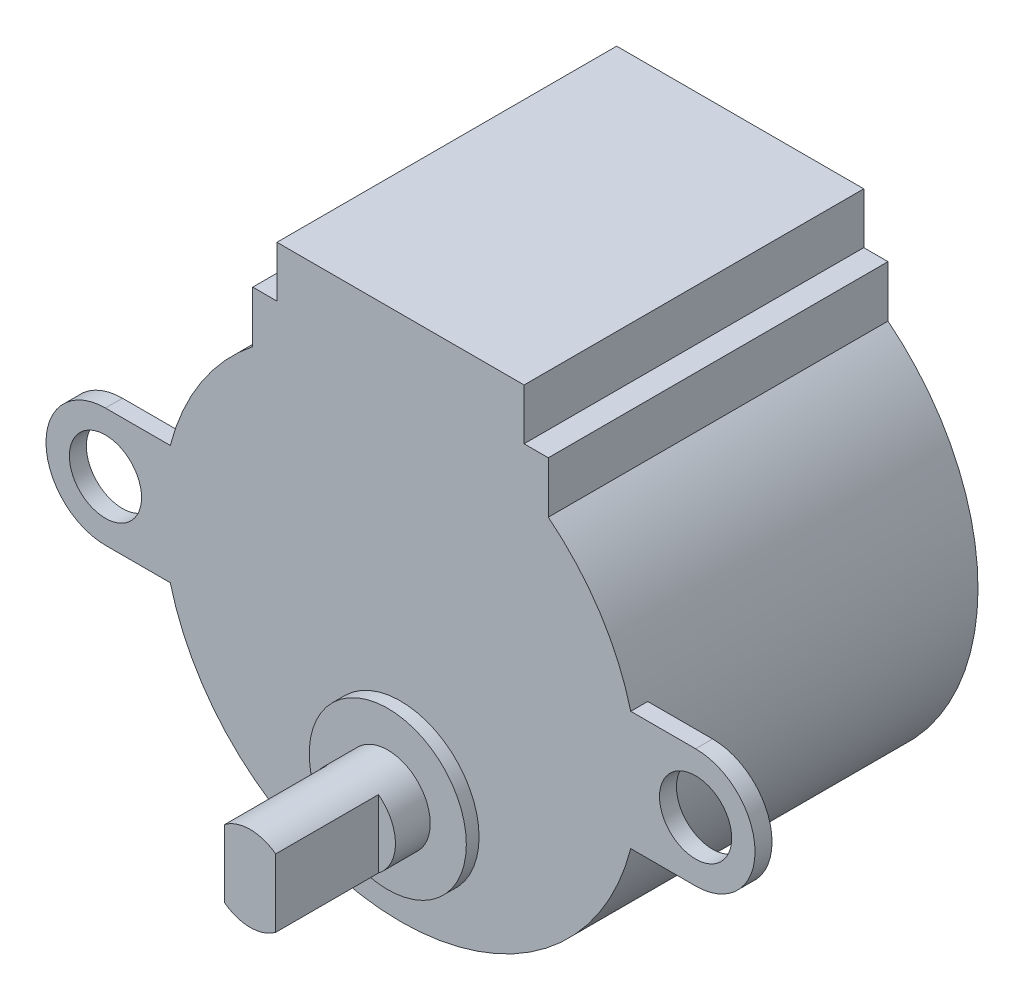
ISO-10303-21;
HEADER;
FILE_DESCRIPTION(('STEP AP214'),'2;1');
FILE_NAME('part.step','',(''),(''),'','','');
FILE_SCHEMA(('AUTOMOTIVE_DESIGN { 1 0 10303 214 1 1 1 1 }'));
ENDSEC;
DATA;
#1=APPLICATION_CONTEXT('core data for automotive mechanical design processes');
#2=APPLICATION_PROTOCOL_DEFINITION('international standard','automotive_design',2000,#1);
#3=PRODUCT_CONTEXT('',#1,'mechanical');
#4=PRODUCT('Part','Part','',(#3));
#5=PRODUCT_RELATED_PRODUCT_CATEGORY('part','',(#4));
#6=PRODUCT_DEFINITION_FORMATION('','',#4);
#7=PRODUCT_DEFINITION_CONTEXT('part definition',#1,'design');
#8=PRODUCT_DEFINITION('design','',#6,#7);
#9=PRODUCT_DEFINITION_SHAPE('','',#8);
#10=(LENGTH_UNIT() NAMED_UNIT(*) SI_UNIT(.MILLI.,.METRE.));
#11=(NAMED_UNIT(*) PLANE_ANGLE_UNIT() SI_UNIT($,.RADIAN.));
#12=(NAMED_UNIT(*) SI_UNIT($,.STERADIAN.) SOLID_ANGLE_UNIT());
#13=UNCERTAINTY_MEASURE_WITH_UNIT(LENGTH_MEASURE(1.E-05),#10,'distance_accuracy_value','');
#14=(GEOMETRIC_REPRESENTATION_CONTEXT(3) GLOBAL_UNCERTAINTY_ASSIGNED_CONTEXT((#13)) GLOBAL_UNIT_ASSIGNED_CONTEXT((#10,
#11,#12)) REPRESENTATION_CONTEXT('',''));
#15=CARTESIAN_POINT('',(0.,0.,0.));
#16=DIRECTION('',(0.,0.,1.));
#17=DIRECTION('',(1.,0.,0.));
#18=AXIS2_PLACEMENT_3D('',#15,#16,#17);
#19=CARTESIAN_POINT('',(0.,0.,22.8));
#20=DIRECTION('',(0.,0.,1.));
#21=DIRECTION('',(1.,0.,0.));
#22=AXIS2_PLACEMENT_3D('',#19,#20,#21);
#23=PLANE('',#22);
#24=DIRECTION('',(0.,-1.,0.));
#25=VECTOR('',#24,1.);
#26=CARTESIAN_POINT('',(-1.5,-9.375,22.8));
#27=LINE('',#26,#25);
#28=CARTESIAN_POINT('',(-1.5,-5.375,22.8));
#29=VERTEX_POINT('',#28);
#30=CARTESIAN_POINT('',(-1.5,-9.375,22.8));
#31=VERTEX_POINT('',#30);
#32=EDGE_CURVE('E196',#29,#31,#27,.T.);
#33=ORIENTED_EDGE('',*,*,#32,.F.);
#34=CARTESIAN_POINT('',(0.,-7.375,22.8));
#35=DIRECTION('',(0.,0.,1.));
#36=DIRECTION('',(1.,0.,0.));
#37=AXIS2_PLACEMENT_3D('',#34,#35,#36);
#38=CIRCLE('',#37,2.5);
#39=EDGE_CURVE('E71',#29,#31,#38,.T.);
#40=ORIENTED_EDGE('',*,*,#39,.T.);
#41=EDGE_LOOP('',(#33,#40));
#42=FACE_BOUND('',#41,.T.);
#43=ADVANCED_FACE('F47',(#42),#23,.T.);
#44=CARTESIAN_POINT('',(-8.7,14.,20.));
#45=DIRECTION('',(0.,-1.,0.));
#46=DIRECTION('',(0.,0.,-1.));
#47=AXIS2_PLACEMENT_3D('',#44,#45,#46);
#48=PLANE('',#47);
#49=DIRECTION('',(-1.,0.,0.));
#50=VECTOR('',#49,1.);
#51=CARTESIAN_POINT('',(-8.7,14.,0.));
#52=LINE('',#51,#50);
#53=CARTESIAN_POINT('',(-7.275,14.,0.));
#54=VERTEX_POINT('',#53);
#55=CARTESIAN_POINT('',(-8.7,14.,0.));
#56=VERTEX_POINT('',#55);
#57=EDGE_CURVE('E320',#54,#56,#52,.T.);
#58=ORIENTED_EDGE('',*,*,#57,.T.);
#59=DIRECTION('',(0.,0.,-1.));
#60=VECTOR('',#59,1.);
#61=CARTESIAN_POINT('',(-8.7,14.,20.));
#62=LINE('',#61,#60);
#63=CARTESIAN_POINT('',(-8.7,14.,20.));
#64=VERTEX_POINT('',#63);
#65=EDGE_CURVE('E400',#64,#56,#62,.T.);
#66=ORIENTED_EDGE('',*,*,#65,.F.);
#67=DIRECTION('',(-1.,0.,0.));
#68=VECTOR('',#67,1.);
#69=CARTESIAN_POINT('',(-8.7,14.,20.));
#70=LINE('',#69,#68);
#71=CARTESIAN_POINT('',(-7.275,14.,20.));
#72=VERTEX_POINT('',#71);
#73=EDGE_CURVE('E321',#72,#64,#70,.T.);
#74=ORIENTED_EDGE('',*,*,#73,.F.);
#75=DIRECTION('',(0.,0.,-1.));
#76=VECTOR('',#75,1.);
#77=CARTESIAN_POINT('',(-7.275,14.,20.));
#78=LINE('',#77,#76);
#79=EDGE_CURVE('E350',#72,#54,#78,.T.);
#80=ORIENTED_EDGE('',*,*,#79,.T.);
#81=EDGE_LOOP('',(#58,#66,#74,#80));
#82=FACE_BOUND('',#81,.T.);
#83=ADVANCED_FACE('F49',(#82),#48,.F.);
#84=CARTESIAN_POINT('',(-8.7,14.,20.));
#85=DIRECTION('',(1.,0.,0.));
#86=DIRECTION('',(0.,0.,-1.));
#87=AXIS2_PLACEMENT_3D('',#84,#85,#86);
#88=PLANE('',#87);
#89=DIRECTION('',(0.,-1.,0.));
#90=VECTOR('',#89,1.);
#91=CARTESIAN_POINT('',(-8.7,14.,0.));
#92=LINE('',#91,#90);
#93=CARTESIAN_POINT('',(-8.7,10.9685915230717,0.));
#94=VERTEX_POINT('',#93);
#95=EDGE_CURVE('E354',#56,#94,#92,.T.);
#96=ORIENTED_EDGE('',*,*,#95,.T.);
#97=DIRECTION('',(0.,0.,-1.));
#98=VECTOR('',#97,1.);
#99=CARTESIAN_POINT('',(-8.7,10.9685915230717,20.));
#100=LINE('',#99,#98);
#101=CARTESIAN_POINT('',(-8.7,10.9685915230717,20.));
#102=VERTEX_POINT('',#101);
#103=EDGE_CURVE('E397',#102,#94,#100,.T.);
#104=ORIENTED_EDGE('',*,*,#103,.F.);
#105=DIRECTION('',(0.,-1.,0.));
#106=VECTOR('',#105,1.);
#107=CARTESIAN_POINT('',(-8.7,14.,20.));
#108=LINE('',#107,#106);
#109=EDGE_CURVE('E325',#64,#102,#108,.T.);
#110=ORIENTED_EDGE('',*,*,#109,.F.);
#111=ORIENTED_EDGE('',*,*,#65,.T.);
#112=EDGE_LOOP('',(#96,#104,#110,#111));
#113=FACE_BOUND('',#112,.T.);
#114=ADVANCED_FACE('F466',(#113),#88,.F.);
#115=CARTESIAN_POINT('',(0.,0.,20.));
#116=DIRECTION('',(0.,0.,-1.));
#117=DIRECTION('',(-1.,0.,0.));
#118=AXIS2_PLACEMENT_3D('',#115,#116,#117);
#119=CYLINDRICAL_SURFACE('',#118,14.);
#120=CARTESIAN_POINT('',(0.,0.,19.));
#121=DIRECTION('',(0.,0.,1.));
#122=DIRECTION('',(1.,0.,0.));
#123=AXIS2_PLACEMENT_3D('',#120,#121,#122);
#124=CIRCLE('',#123,14.);
#125=CARTESIAN_POINT('',(-13.555441711726,3.5,19.));
#126=VERTEX_POINT('',#125);
#127=CARTESIAN_POINT('',(-13.555441711726,-3.5,19.));
#128=VERTEX_POINT('',#127);
#129=EDGE_CURVE('E57',#126,#128,#124,.T.);
#130=ORIENTED_EDGE('',*,*,#129,.F.);
#131=DIRECTION('',(0.,0.,-1.));
#132=VECTOR('',#131,1.);
#133=CARTESIAN_POINT('',(-13.555441711726,3.5,20.));
#134=LINE('',#133,#132);
#135=CARTESIAN_POINT('',(-13.555441711726,3.5,20.));
#136=VERTEX_POINT('',#135);
#137=EDGE_CURVE('E312',#126,#136,#134,.F.);
#138=ORIENTED_EDGE('',*,*,#137,.T.);
#139=CARTESIAN_POINT('',(0.,0.,20.));
#140=DIRECTION('',(0.,0.,1.));
#141=DIRECTION('',(1.,0.,0.));
#142=AXIS2_PLACEMENT_3D('',#139,#140,#141);
#143=CIRCLE('',#142,14.);
#144=EDGE_CURVE('E330',#102,#136,#143,.T.);
#145=ORIENTED_EDGE('',*,*,#144,.F.);
#146=ORIENTED_EDGE('',*,*,#103,.T.);
#147=CARTESIAN_POINT('',(0.,0.,0.));
#148=DIRECTION('',(0.,0.,1.));
#149=DIRECTION('',(1.,0.,0.));
#150=AXIS2_PLACEMENT_3D('',#147,#148,#149);
#151=CIRCLE('',#150,14.);
#152=CARTESIAN_POINT('',(8.7,10.9685915230717,0.));
#153=VERTEX_POINT('',#152);
#154=EDGE_CURVE('E357',#94,#153,#151,.T.);
#155=ORIENTED_EDGE('',*,*,#154,.T.);
#156=DIRECTION('',(0.,0.,-1.));
#157=VECTOR('',#156,1.);
#158=CARTESIAN_POINT('',(8.7,10.9685915230717,20.));
#159=LINE('',#158,#157);
#160=CARTESIAN_POINT('',(8.7,10.9685915230717,20.));
#161=VERTEX_POINT('',#160);
#162=EDGE_CURVE('E393',#161,#153,#159,.T.);
#163=ORIENTED_EDGE('',*,*,#162,.F.);
#164=CARTESIAN_POINT('',(13.555441711726,3.5,20.));
#165=VERTEX_POINT('',#164);
#166=EDGE_CURVE('E329',#165,#161,#143,.T.);
#167=ORIENTED_EDGE('',*,*,#166,.F.);
#168=DIRECTION('',(0.,0.,-1.));
#169=VECTOR('',#168,1.);
#170=CARTESIAN_POINT('',(13.555441711726,3.5,20.));
#171=LINE('',#170,#169);
#172=CARTESIAN_POINT('',(13.555441711726,3.5,19.));
#173=VERTEX_POINT('',#172);
#174=EDGE_CURVE('E316',#165,#173,#171,.T.);
#175=ORIENTED_EDGE('',*,*,#174,.T.);
#176=CARTESIAN_POINT('',(13.555441711726,-3.5,19.));
#177=VERTEX_POINT('',#176);
#178=EDGE_CURVE('E51',#177,#173,#124,.T.);
#179=ORIENTED_EDGE('',*,*,#178,.F.);
#180=DIRECTION('',(0.,0.,-1.));
#181=VECTOR('',#180,1.);
#182=CARTESIAN_POINT('',(13.555441711726,-3.5,20.));
#183=LINE('',#182,#181);
#184=CARTESIAN_POINT('',(13.555441711726,-3.5,20.));
#185=VERTEX_POINT('',#184);
#186=EDGE_CURVE('E295',#177,#185,#183,.F.);
#187=ORIENTED_EDGE('',*,*,#186,.T.);
#188=CARTESIAN_POINT('',(-13.555441711726,-3.5,20.));
#189=VERTEX_POINT('',#188);
#190=EDGE_CURVE('E335',#189,#185,#143,.T.);
#191=ORIENTED_EDGE('',*,*,#190,.F.);
#192=DIRECTION('',(0.,0.,-1.));
#193=VECTOR('',#192,1.);
#194=CARTESIAN_POINT('',(-13.555441711726,-3.5,20.));
#195=LINE('',#194,#193);
#196=EDGE_CURVE('E308',#189,#128,#195,.T.);
#197=ORIENTED_EDGE('',*,*,#196,.T.);
#198=EDGE_LOOP('',(#130,#138,#145,#146,#155,#163,#167,#175,#179,#187,#191,#197));
#199=FACE_BOUND('',#198,.T.);
#200=ADVANCED_FACE('F423',(#199),#119,.T.);
#201=CARTESIAN_POINT('',(8.7,14.,20.));
#202=DIRECTION('',(-1.,0.,0.));
#203=DIRECTION('',(0.,0.,1.));
#204=AXIS2_PLACEMENT_3D('',#201,#202,#203);
#205=PLANE('',#204);
#206=DIRECTION('',(0.,1.,0.));
#207=VECTOR('',#206,1.);
#208=CARTESIAN_POINT('',(8.7,14.,0.));
#209=LINE('',#208,#207);
#210=CARTESIAN_POINT('',(8.7,14.,0.));
#211=VERTEX_POINT('',#210);
#212=EDGE_CURVE('E360',#153,#211,#209,.T.);
#213=ORIENTED_EDGE('',*,*,#212,.T.);
#214=DIRECTION('',(0.,0.,-1.));
#215=VECTOR('',#214,1.);
#216=CARTESIAN_POINT('',(8.7,14.,20.));
#217=LINE('',#216,#215);
#218=CARTESIAN_POINT('',(8.7,14.,20.));
#219=VERTEX_POINT('',#218);
#220=EDGE_CURVE('E389',#219,#211,#217,.T.);
#221=ORIENTED_EDGE('',*,*,#220,.F.);
#222=DIRECTION('',(0.,1.,0.));
#223=VECTOR('',#222,1.);
#224=CARTESIAN_POINT('',(8.7,14.,20.));
#225=LINE('',#224,#223);
#226=EDGE_CURVE('E334',#161,#219,#225,.T.);
#227=ORIENTED_EDGE('',*,*,#226,.F.);
#228=ORIENTED_EDGE('',*,*,#162,.T.);
#229=EDGE_LOOP('',(#213,#221,#227,#228));
#230=FACE_BOUND('',#229,.T.);
#231=ADVANCED_FACE('F439',(#230),#205,.F.);
#232=CARTESIAN_POINT('',(7.275,14.,20.));
#233=DIRECTION('',(0.,-1.,0.));
#234=DIRECTION('',(0.,0.,-1.));
#235=AXIS2_PLACEMENT_3D('',#232,#233,#234);
#236=PLANE('',#235);
#237=DIRECTION('',(-1.,0.,0.));
#238=VECTOR('',#237,1.);
#239=CARTESIAN_POINT('',(7.275,14.,0.));
#240=LINE('',#239,#238);
#241=CARTESIAN_POINT('',(7.275,14.,0.));
#242=VERTEX_POINT('',#241);
#243=EDGE_CURVE('E363',#211,#242,#240,.T.);
#244=ORIENTED_EDGE('',*,*,#243,.T.);
#245=DIRECTION('',(0.,0.,-1.));
#246=VECTOR('',#245,1.);
#247=CARTESIAN_POINT('',(7.275,14.,20.));
#248=LINE('',#247,#246);
#249=CARTESIAN_POINT('',(7.275,14.,20.));
#250=VERTEX_POINT('',#249);
#251=EDGE_CURVE('E385',#250,#242,#248,.T.);
#252=ORIENTED_EDGE('',*,*,#251,.F.);
#253=DIRECTION('',(-1.,0.,0.));
#254=VECTOR('',#253,1.);
#255=CARTESIAN_POINT('',(7.275,14.,20.));
#256=LINE('',#255,#254);
#257=EDGE_CURVE('E338',#219,#250,#256,.T.);
#258=ORIENTED_EDGE('',*,*,#257,.F.);
#259=ORIENTED_EDGE('',*,*,#220,.T.);
#260=EDGE_LOOP('',(#244,#252,#258,#259));
#261=FACE_BOUND('',#260,.T.);
#262=ADVANCED_FACE('F444',(#261),#236,.F.);
#263=CARTESIAN_POINT('',(7.275,17.,20.));
#264=DIRECTION('',(-1.,0.,0.));
#265=DIRECTION('',(0.,0.,1.));
#266=AXIS2_PLACEMENT_3D('',#263,#264,#265);
#267=PLANE('',#266);
#268=DIRECTION('',(0.,1.,0.));
#269=VECTOR('',#268,1.);
#270=CARTESIAN_POINT('',(7.275,17.,0.));
#271=LINE('',#270,#269);
#272=CARTESIAN_POINT('',(7.275,17.,0.));
#273=VERTEX_POINT('',#272);
#274=EDGE_CURVE('E366',#242,#273,#271,.T.);
#275=ORIENTED_EDGE('',*,*,#274,.T.);
#276=DIRECTION('',(0.,0.,-1.));
#277=VECTOR('',#276,1.);
#278=CARTESIAN_POINT('',(7.275,17.,20.));
#279=LINE('',#278,#277);
#280=CARTESIAN_POINT('',(7.275,17.,20.));
#281=VERTEX_POINT('',#280);
#282=EDGE_CURVE('E381',#281,#273,#279,.T.);
#283=ORIENTED_EDGE('',*,*,#282,.F.);
#284=DIRECTION('',(0.,1.,0.));
#285=VECTOR('',#284,1.);
#286=CARTESIAN_POINT('',(7.275,17.,20.));
#287=LINE('',#286,#285);
#288=EDGE_CURVE('E341',#250,#281,#287,.T.);
#289=ORIENTED_EDGE('',*,*,#288,.F.);
#290=ORIENTED_EDGE('',*,*,#251,.T.);
#291=EDGE_LOOP('',(#275,#283,#289,#290));
#292=FACE_BOUND('',#291,.T.);
#293=ADVANCED_FACE('F450',(#292),#267,.F.);
#294=CARTESIAN_POINT('',(-7.275,17.,20.));
#295=DIRECTION('',(0.,-1.,0.));
#296=DIRECTION('',(1.,0.,0.));
#297=AXIS2_PLACEMENT_3D('',#294,#295,#296);
#298=PLANE('',#297);
#299=DIRECTION('',(-1.,0.,0.));
#300=VECTOR('',#299,1.);
#301=CARTESIAN_POINT('',(-7.275,17.,0.));
#302=LINE('',#301,#300);
#303=CARTESIAN_POINT('',(-7.275,17.,0.));
#304=VERTEX_POINT('',#303);
#305=EDGE_CURVE('E369',#273,#304,#302,.T.);
#306=ORIENTED_EDGE('',*,*,#305,.T.);
#307=DIRECTION('',(0.,0.,-1.));
#308=VECTOR('',#307,1.);
#309=CARTESIAN_POINT('',(-7.275,17.,20.));
#310=LINE('',#309,#308);
#311=CARTESIAN_POINT('',(-7.275,17.,20.));
#312=VERTEX_POINT('',#311);
#313=EDGE_CURVE('E377',#312,#304,#310,.T.);
#314=ORIENTED_EDGE('',*,*,#313,.F.);
#315=DIRECTION('',(-1.,0.,0.));
#316=VECTOR('',#315,1.);
#317=CARTESIAN_POINT('',(-7.275,17.,20.));
#318=LINE('',#317,#316);
#319=EDGE_CURVE('E344',#281,#312,#318,.T.);
#320=ORIENTED_EDGE('',*,*,#319,.F.);
#321=ORIENTED_EDGE('',*,*,#282,.T.);
#322=EDGE_LOOP('',(#306,#314,#320,#321));
#323=FACE_BOUND('',#322,.T.);
#324=ADVANCED_FACE('F454',(#323),#298,.F.);
#325=CARTESIAN_POINT('',(-7.275,17.,20.));
#326=DIRECTION('',(1.,0.,0.));
#327=DIRECTION('',(0.,0.,-1.));
#328=AXIS2_PLACEMENT_3D('',#325,#326,#327);
#329=PLANE('',#328);
#330=DIRECTION('',(0.,-1.,0.));
#331=VECTOR('',#330,1.);
#332=CARTESIAN_POINT('',(-7.275,17.,0.));
#333=LINE('',#332,#331);
#334=EDGE_CURVE('E326',#304,#54,#333,.T.);
#335=ORIENTED_EDGE('',*,*,#334,.T.);
#336=ORIENTED_EDGE('',*,*,#79,.F.);
#337=DIRECTION('',(0.,-1.,0.));
#338=VECTOR('',#337,1.);
#339=CARTESIAN_POINT('',(-7.275,17.,20.));
#340=LINE('',#339,#338);
#341=EDGE_CURVE('E347',#312,#72,#340,.T.);
#342=ORIENTED_EDGE('',*,*,#341,.F.);
#343=ORIENTED_EDGE('',*,*,#313,.T.);
#344=EDGE_LOOP('',(#335,#336,#342,#343));
#345=FACE_BOUND('',#344,.T.);
#346=ADVANCED_FACE('F459',(#345),#329,.F.);
#347=CARTESIAN_POINT('',(0.,0.,20.));
#348=DIRECTION('',(0.,0.,1.));
#349=DIRECTION('',(1.,0.,0.));
#350=AXIS2_PLACEMENT_3D('',#347,#348,#349);
#351=PLANE('',#350);
#352=CARTESIAN_POINT('',(0.,-7.375,20.));
#353=DIRECTION('',(0.,0.,1.));
#354=DIRECTION('',(1.,0.,0.));
#355=AXIS2_PLACEMENT_3D('',#352,#353,#354);
#356=CIRCLE('',#355,4.625);
#357=CARTESIAN_POINT('',(4.625,-7.375,20.));
#358=VERTEX_POINT('',#357);
#359=EDGE_CURVE('E232',#358,#358,#356,.T.);
#360=ORIENTED_EDGE('',*,*,#359,.F.);
#361=EDGE_LOOP('',(#360));
#362=FACE_BOUND('',#361,.T.);
#363=ORIENTED_EDGE('',*,*,#190,.T.);
#364=DIRECTION('',(1.,0.,0.));
#365=VECTOR('',#364,1.);
#366=CARTESIAN_POINT('',(-17.3723550881823,-3.5,20.));
#367=LINE('',#366,#365);
#368=CARTESIAN_POINT('',(17.3723550881823,-3.5,20.));
#369=VERTEX_POINT('',#368);
#370=EDGE_CURVE('E280',#185,#369,#367,.T.);
#371=ORIENTED_EDGE('',*,*,#370,.T.);
#372=CARTESIAN_POINT('',(17.3723550881823,0.,20.));
#373=DIRECTION('',(0.,0.,1.));
#374=DIRECTION('',(-1.,0.,0.));
#375=AXIS2_PLACEMENT_3D('',#372,#373,#374);
#376=CIRCLE('',#375,3.5);
#377=CARTESIAN_POINT('',(17.3723550881823,3.5,20.));
#378=VERTEX_POINT('',#377);
#379=EDGE_CURVE('E284',#369,#378,#376,.T.);
#380=ORIENTED_EDGE('',*,*,#379,.T.);
#381=DIRECTION('',(-1.,0.,0.));
#382=VECTOR('',#381,1.);
#383=CARTESIAN_POINT('',(-17.3723550881823,3.5,20.));
#384=LINE('',#383,#382);
#385=EDGE_CURVE('E262',#378,#165,#384,.T.);
#386=ORIENTED_EDGE('',*,*,#385,.T.);
#387=ORIENTED_EDGE('',*,*,#166,.T.);
#388=ORIENTED_EDGE('',*,*,#226,.T.);
#389=ORIENTED_EDGE('',*,*,#257,.T.);
#390=ORIENTED_EDGE('',*,*,#288,.T.);
#391=ORIENTED_EDGE('',*,*,#319,.T.);
#392=ORIENTED_EDGE('',*,*,#341,.T.);
#393=ORIENTED_EDGE('',*,*,#73,.T.);
#394=ORIENTED_EDGE('',*,*,#109,.T.);
#395=ORIENTED_EDGE('',*,*,#144,.T.);
#396=CARTESIAN_POINT('',(-17.3723550881823,3.5,20.));
#397=VERTEX_POINT('',#396);
#398=EDGE_CURVE('E288',#136,#397,#384,.T.);
#399=ORIENTED_EDGE('',*,*,#398,.T.);
#400=CARTESIAN_POINT('',(-17.3723550881823,0.,20.));
#401=DIRECTION('',(0.,0.,1.));
#402=DIRECTION('',(1.,0.,0.));
#403=AXIS2_PLACEMENT_3D('',#400,#401,#402);
#404=CIRCLE('',#403,3.5);
#405=CARTESIAN_POINT('',(-17.3723550881823,-3.5,20.));
#406=VERTEX_POINT('',#405);
#407=EDGE_CURVE('E253',#397,#406,#404,.T.);
#408=ORIENTED_EDGE('',*,*,#407,.T.);
#409=EDGE_CURVE('E281',#406,#189,#367,.T.);
#410=ORIENTED_EDGE('',*,*,#409,.T.);
#411=EDGE_LOOP('',(#363,#371,#380,#386,#387,#388,#389,#390,#391,#392,#393,#394,#395,#399,#408,#410));
#412=FACE_BOUND('',#411,.T.);
#413=CARTESIAN_POINT('',(17.3723550881823,0.,20.));
#414=DIRECTION('',(0.,0.,1.));
#415=DIRECTION('',(-1.,0.,0.));
#416=AXIS2_PLACEMENT_3D('',#413,#414,#415);
#417=CIRCLE('',#416,2.125);
#418=CARTESIAN_POINT('',(15.2473550881823,0.,20.));
#419=VERTEX_POINT('',#418);
#420=EDGE_CURVE('E240',#419,#419,#417,.T.);
#421=ORIENTED_EDGE('',*,*,#420,.F.);
#422=EDGE_LOOP('',(#421));
#423=FACE_BOUND('',#422,.T.);
#424=CARTESIAN_POINT('',(-17.3723550881823,0.,20.));
#425=DIRECTION('',(0.,0.,1.));
#426=DIRECTION('',(1.,0.,0.));
#427=AXIS2_PLACEMENT_3D('',#424,#425,#426);
#428=CIRCLE('',#427,2.125);
#429=CARTESIAN_POINT('',(-15.2473550881823,0.,20.));
#430=VERTEX_POINT('',#429);
#431=EDGE_CURVE('E245',#430,#430,#428,.T.);
#432=ORIENTED_EDGE('',*,*,#431,.F.);
#433=EDGE_LOOP('',(#432));
#434=FACE_BOUND('',#433,.T.);
#435=ADVANCED_FACE('F430',(#362,#412,#423,#434),#351,.T.);
#436=CARTESIAN_POINT('',(0.,0.,0.));
#437=DIRECTION('',(0.,0.,1.));
#438=DIRECTION('',(1.,0.,0.));
#439=AXIS2_PLACEMENT_3D('',#436,#437,#438);
#440=PLANE('',#439);
#441=ORIENTED_EDGE('',*,*,#57,.F.);
#442=ORIENTED_EDGE('',*,*,#334,.F.);
#443=ORIENTED_EDGE('',*,*,#305,.F.);
#444=ORIENTED_EDGE('',*,*,#274,.F.);
#445=ORIENTED_EDGE('',*,*,#243,.F.);
#446=ORIENTED_EDGE('',*,*,#212,.F.);
#447=ORIENTED_EDGE('',*,*,#154,.F.);
#448=ORIENTED_EDGE('',*,*,#95,.F.);
#449=EDGE_LOOP('',(#441,#442,#443,#444,#445,#446,#447,#448));
#450=FACE_BOUND('',#449,.T.);
#451=ADVANCED_FACE('F465',(#450),#440,.F.);
#452=CARTESIAN_POINT('',(17.3723550881823,0.,19.));
#453=DIRECTION('',(0.,0.,1.));
#454=DIRECTION('',(1.,0.,0.));
#455=AXIS2_PLACEMENT_3D('',#452,#453,#454);
#456=CYLINDRICAL_SURFACE('',#455,2.125);
#457=CARTESIAN_POINT('',(17.3723550881823,0.,19.));
#458=DIRECTION('',(0.,0.,1.));
#459=DIRECTION('',(-1.,0.,0.));
#460=AXIS2_PLACEMENT_3D('',#457,#458,#459);
#461=CIRCLE('',#460,2.125);
#462=CARTESIAN_POINT('',(15.2473550881823,0.,19.));
#463=VERTEX_POINT('',#462);
#464=EDGE_CURVE('E241',#463,#463,#461,.T.);
#465=ORIENTED_EDGE('',*,*,#464,.F.);
#466=EDGE_LOOP('',(#465));
#467=FACE_BOUND('',#466,.T.);
#468=ORIENTED_EDGE('',*,*,#420,.T.);
#469=EDGE_LOOP('',(#468));
#470=FACE_BOUND('',#469,.T.);
#471=ADVANCED_FACE('F656',(#467,#470),#456,.F.);
#472=CARTESIAN_POINT('',(17.3723550881823,0.,19.));
#473=DIRECTION('',(0.,0.,1.));
#474=DIRECTION('',(1.,0.,0.));
#475=AXIS2_PLACEMENT_3D('',#472,#473,#474);
#476=CYLINDRICAL_SURFACE('',#475,3.5);
#477=ORIENTED_EDGE('',*,*,#379,.F.);
#478=DIRECTION('',(0.,0.,1.));
#479=VECTOR('',#478,1.);
#480=CARTESIAN_POINT('',(17.3723550881823,-3.5,19.));
#481=LINE('',#480,#479);
#482=CARTESIAN_POINT('',(17.3723550881823,-3.5,19.));
#483=VERTEX_POINT('',#482);
#484=EDGE_CURVE('E299',#483,#369,#481,.T.);
#485=ORIENTED_EDGE('',*,*,#484,.F.);
#486=CARTESIAN_POINT('',(17.3723550881823,0.,19.));
#487=DIRECTION('',(0.,0.,1.));
#488=DIRECTION('',(-1.,0.,0.));
#489=AXIS2_PLACEMENT_3D('',#486,#487,#488);
#490=CIRCLE('',#489,3.5);
#491=CARTESIAN_POINT('',(17.3723550881823,3.5,19.));
#492=VERTEX_POINT('',#491);
#493=EDGE_CURVE('E267',#483,#492,#490,.T.);
#494=ORIENTED_EDGE('',*,*,#493,.T.);
#495=DIRECTION('',(0.,0.,1.));
#496=VECTOR('',#495,1.);
#497=CARTESIAN_POINT('',(17.3723550881823,3.5,19.));
#498=LINE('',#497,#496);
#499=EDGE_CURVE('E296',#492,#378,#498,.T.);
#500=ORIENTED_EDGE('',*,*,#499,.T.);
#501=EDGE_LOOP('',(#477,#485,#494,#500));
#502=FACE_BOUND('',#501,.T.);
#503=ADVANCED_FACE('F646',(#502),#476,.T.);
#504=CARTESIAN_POINT('',(-17.3723550881823,0.,19.));
#505=DIRECTION('',(0.,0.,1.));
#506=DIRECTION('',(1.,0.,0.));
#507=AXIS2_PLACEMENT_3D('',#504,#505,#506);
#508=PLANE('',#507);
#509=ORIENTED_EDGE('',*,*,#464,.T.);
#510=EDGE_LOOP('',(#509));
#511=FACE_BOUND('',#510,.T.);
#512=DIRECTION('',(1.,0.,0.));
#513=VECTOR('',#512,1.);
#514=CARTESIAN_POINT('',(-17.3723550881823,-3.5,19.));
#515=LINE('',#514,#513);
#516=EDGE_CURVE('E261',#177,#483,#515,.T.);
#517=ORIENTED_EDGE('',*,*,#516,.F.);
#518=ORIENTED_EDGE('',*,*,#178,.T.);
#519=DIRECTION('',(-1.,0.,0.));
#520=VECTOR('',#519,1.);
#521=CARTESIAN_POINT('',(-17.3723550881823,3.5,19.));
#522=LINE('',#521,#520);
#523=EDGE_CURVE('E272',#492,#173,#522,.T.);
#524=ORIENTED_EDGE('',*,*,#523,.F.);
#525=ORIENTED_EDGE('',*,*,#493,.F.);
#526=EDGE_LOOP('',(#517,#518,#524,#525));
#527=FACE_BOUND('',#526,.T.);
#528=ADVANCED_FACE('F619',(#511,#527),#508,.F.);
#529=CARTESIAN_POINT('',(-17.3723550881823,-3.5,19.));
#530=DIRECTION('',(0.,-1.,0.));
#531=DIRECTION('',(0.,0.,-1.));
#532=AXIS2_PLACEMENT_3D('',#529,#530,#531);
#533=PLANE('',#532);
#534=ORIENTED_EDGE('',*,*,#186,.F.);
#535=ORIENTED_EDGE('',*,*,#516,.T.);
#536=ORIENTED_EDGE('',*,*,#484,.T.);
#537=ORIENTED_EDGE('',*,*,#370,.F.);
#538=EDGE_LOOP('',(#534,#535,#536,#537));
#539=FACE_BOUND('',#538,.T.);
#540=ADVANCED_FACE('F486',(#539),#533,.T.);
#541=CARTESIAN_POINT('',(-17.3723550881823,3.5,19.));
#542=DIRECTION('',(0.,1.,0.));
#543=DIRECTION('',(0.,0.,1.));
#544=AXIS2_PLACEMENT_3D('',#541,#542,#543);
#545=PLANE('',#544);
#546=ORIENTED_EDGE('',*,*,#174,.F.);
#547=ORIENTED_EDGE('',*,*,#385,.F.);
#548=ORIENTED_EDGE('',*,*,#499,.F.);
#549=ORIENTED_EDGE('',*,*,#523,.T.);
#550=EDGE_LOOP('',(#546,#547,#548,#549));
#551=FACE_BOUND('',#550,.T.);
#552=ADVANCED_FACE('F608',(#551),#545,.T.);
#553=CARTESIAN_POINT('',(-17.3723550881823,0.,19.));
#554=DIRECTION('',(0.,0.,1.));
#555=DIRECTION('',(1.,0.,0.));
#556=AXIS2_PLACEMENT_3D('',#553,#554,#555);
#557=CIRCLE('',#556,2.125);
#558=CARTESIAN_POINT('',(-15.2473550881823,0.,19.));
#559=VERTEX_POINT('',#558);
#560=EDGE_CURVE('E249',#559,#559,#557,.T.);
#561=ORIENTED_EDGE('',*,*,#560,.T.);
#562=EDGE_LOOP('',(#561));
#563=FACE_BOUND('',#562,.T.);
#564=CARTESIAN_POINT('',(-17.3723550881823,3.5,19.));
#565=VERTEX_POINT('',#564);
#566=EDGE_CURVE('E271',#126,#565,#522,.T.);
#567=ORIENTED_EDGE('',*,*,#566,.F.);
#568=ORIENTED_EDGE('',*,*,#129,.T.);
#569=CARTESIAN_POINT('',(-17.3723550881823,-3.5,19.));
#570=VERTEX_POINT('',#569);
#571=EDGE_CURVE('E263',#570,#128,#515,.T.);
#572=ORIENTED_EDGE('',*,*,#571,.F.);
#573=CARTESIAN_POINT('',(-17.3723550881823,0.,19.));
#574=DIRECTION('',(0.,0.,1.));
#575=DIRECTION('',(1.,0.,0.));
#576=AXIS2_PLACEMENT_3D('',#573,#574,#575);
#577=CIRCLE('',#576,3.5);
#578=EDGE_CURVE('E257',#565,#570,#577,.T.);
#579=ORIENTED_EDGE('',*,*,#578,.F.);
#580=EDGE_LOOP('',(#567,#568,#572,#579));
#581=FACE_BOUND('',#580,.T.);
#582=ADVANCED_FACE('F415',(#563,#581),#508,.F.);
#583=ORIENTED_EDGE('',*,*,#137,.F.);
#584=ORIENTED_EDGE('',*,*,#566,.T.);
#585=DIRECTION('',(0.,0.,1.));
#586=VECTOR('',#585,1.);
#587=CARTESIAN_POINT('',(-17.3723550881823,3.5,19.));
#588=LINE('',#587,#586);
#589=EDGE_CURVE('E291',#565,#397,#588,.T.);
#590=ORIENTED_EDGE('',*,*,#589,.T.);
#591=ORIENTED_EDGE('',*,*,#398,.F.);
#592=EDGE_LOOP('',(#583,#584,#590,#591));
#593=FACE_BOUND('',#592,.T.);
#594=ADVANCED_FACE('F472',(#593),#545,.T.);
#595=ORIENTED_EDGE('',*,*,#196,.F.);
#596=ORIENTED_EDGE('',*,*,#409,.F.);
#597=DIRECTION('',(0.,0.,1.));
#598=VECTOR('',#597,1.);
#599=CARTESIAN_POINT('',(-17.3723550881823,-3.5,19.));
#600=LINE('',#599,#598);
#601=EDGE_CURVE('E276',#570,#406,#600,.T.);
#602=ORIENTED_EDGE('',*,*,#601,.F.);
#603=ORIENTED_EDGE('',*,*,#571,.T.);
#604=EDGE_LOOP('',(#595,#596,#602,#603));
#605=FACE_BOUND('',#604,.T.);
#606=ADVANCED_FACE('F420',(#605),#533,.T.);
#607=CARTESIAN_POINT('',(-17.3723550881823,0.,19.));
#608=DIRECTION('',(0.,0.,1.));
#609=DIRECTION('',(1.,0.,0.));
#610=AXIS2_PLACEMENT_3D('',#607,#608,#609);
#611=CYLINDRICAL_SURFACE('',#610,3.5);
#612=ORIENTED_EDGE('',*,*,#407,.F.);
#613=ORIENTED_EDGE('',*,*,#589,.F.);
#614=ORIENTED_EDGE('',*,*,#578,.T.);
#615=ORIENTED_EDGE('',*,*,#601,.T.);
#616=EDGE_LOOP('',(#612,#613,#614,#615));
#617=FACE_BOUND('',#616,.T.);
#618=ADVANCED_FACE('F474',(#617),#611,.T.);
#619=CARTESIAN_POINT('',(-17.3723550881823,0.,19.));
#620=DIRECTION('',(0.,0.,1.));
#621=DIRECTION('',(1.,0.,0.));
#622=AXIS2_PLACEMENT_3D('',#619,#620,#621);
#623=CYLINDRICAL_SURFACE('',#622,2.125);
#624=ORIENTED_EDGE('',*,*,#560,.F.);
#625=EDGE_LOOP('',(#624));
#626=FACE_BOUND('',#625,.T.);
#627=ORIENTED_EDGE('',*,*,#431,.T.);
#628=EDGE_LOOP('',(#627));
#629=FACE_BOUND('',#628,.T.);
#630=ADVANCED_FACE('F476',(#626,#629),#623,.F.);
#631=CARTESIAN_POINT('',(0.,-7.375,54.5814754519511));
#632=DIRECTION('',(0.,0.,-1.));
#633=DIRECTION('',(-1.,0.,0.));
#634=AXIS2_PLACEMENT_3D('',#631,#632,#633);
#635=CYLINDRICAL_SURFACE('',#634,4.625);
#636=ORIENTED_EDGE('',*,*,#359,.T.);
#637=EDGE_LOOP('',(#636));
#638=FACE_BOUND('',#637,.T.);
#639=CARTESIAN_POINT('',(0.,-7.375,20.75));
#640=DIRECTION('',(0.,0.,1.));
#641=DIRECTION('',(1.,0.,0.));
#642=AXIS2_PLACEMENT_3D('',#639,#640,#641);
#643=CIRCLE('',#642,4.625);
#644=CARTESIAN_POINT('',(4.625,-7.375,20.75));
#645=VERTEX_POINT('',#644);
#646=EDGE_CURVE('E236',#645,#645,#643,.T.);
#647=ORIENTED_EDGE('',*,*,#646,.F.);
#648=EDGE_LOOP('',(#647));
#649=FACE_BOUND('',#648,.T.);
#650=ADVANCED_FACE('F482',(#638,#649),#635,.T.);
#651=CARTESIAN_POINT('',(0.,0.,20.75));
#652=DIRECTION('',(0.,0.,1.));
#653=DIRECTION('',(1.,0.,0.));
#654=AXIS2_PLACEMENT_3D('',#651,#652,#653);
#655=PLANE('',#654);
#656=CARTESIAN_POINT('',(0.,-7.375,20.75));
#657=DIRECTION('',(0.,0.,1.));
#658=DIRECTION('',(1.,0.,0.));
#659=AXIS2_PLACEMENT_3D('',#656,#657,#658);
#660=CIRCLE('',#659,2.5);
#661=CARTESIAN_POINT('',(2.5,-7.375,20.75));
#662=VERTEX_POINT('',#661);
#663=EDGE_CURVE('E12',#662,#662,#660,.T.);
#664=ORIENTED_EDGE('',*,*,#663,.F.);
#665=EDGE_LOOP('',(#664));
#666=FACE_BOUND('',#665,.T.);
#667=ORIENTED_EDGE('',*,*,#646,.T.);
#668=EDGE_LOOP('',(#667));
#669=FACE_BOUND('',#668,.T.);
#670=ADVANCED_FACE('F504',(#666,#669),#655,.T.);
#671=CARTESIAN_POINT('',(0.,-7.375,52.6710678118655));
#672=DIRECTION('',(0.,0.,-1.));
#673=DIRECTION('',(-1.,0.,0.));
#674=AXIS2_PLACEMENT_3D('',#671,#672,#673);
#675=CYLINDRICAL_SURFACE('',#674,2.5);
#676=ORIENTED_EDGE('',*,*,#663,.T.);
#677=EDGE_LOOP('',(#676));
#678=FACE_BOUND('',#677,.T.);
#679=ORIENTED_EDGE('',*,*,#39,.F.);
#680=DIRECTION('',(0.,0.,-1.));
#681=VECTOR('',#680,1.);
#682=CARTESIAN_POINT('',(-1.5,-5.375,63.5309518948453));
#683=LINE('',#682,#681);
#684=CARTESIAN_POINT('',(-1.5,-5.375,28.85));
#685=VERTEX_POINT('',#684);
#686=EDGE_CURVE('E186',#685,#29,#683,.T.);
#687=ORIENTED_EDGE('',*,*,#686,.F.);
#688=CARTESIAN_POINT('',(0.,-7.375,28.85));
#689=DIRECTION('',(0.,0.,1.));
#690=DIRECTION('',(1.,0.,0.));
#691=AXIS2_PLACEMENT_3D('',#688,#689,#690);
#692=CIRCLE('',#691,2.5);
#693=CARTESIAN_POINT('',(1.5,-5.375,28.85));
#694=VERTEX_POINT('',#693);
#695=EDGE_CURVE('E191',#694,#685,#692,.T.);
#696=ORIENTED_EDGE('',*,*,#695,.F.);
#697=DIRECTION('',(0.,0.,-1.));
#698=VECTOR('',#697,1.);
#699=CARTESIAN_POINT('',(1.5,-5.375,63.5309518948453));
#700=LINE('',#699,#698);
#701=CARTESIAN_POINT('',(1.5,-5.375,22.8));
#702=VERTEX_POINT('',#701);
#703=EDGE_CURVE('E197',#694,#702,#700,.T.);
#704=ORIENTED_EDGE('',*,*,#703,.T.);
#705=CARTESIAN_POINT('',(1.5,-9.37500000000001,22.8));
#706=VERTEX_POINT('',#705);
#707=EDGE_CURVE('E213',#706,#702,#38,.T.);
#708=ORIENTED_EDGE('',*,*,#707,.F.);
#709=DIRECTION('',(0.,0.,-1.));
#710=VECTOR('',#709,1.);
#711=CARTESIAN_POINT('',(1.5,-9.37500000000001,63.5309518948453));
#712=LINE('',#711,#710);
#713=CARTESIAN_POINT('',(1.5,-9.37500000000001,28.85));
#714=VERTEX_POINT('',#713);
#715=EDGE_CURVE('E224',#714,#706,#712,.T.);
#716=ORIENTED_EDGE('',*,*,#715,.F.);
#717=CARTESIAN_POINT('',(0.,-7.375,28.85));
#718=DIRECTION('',(0.,0.,1.));
#719=DIRECTION('',(1.,0.,0.));
#720=AXIS2_PLACEMENT_3D('',#717,#718,#719);
#721=CIRCLE('',#720,2.5);
#722=CARTESIAN_POINT('',(-1.5,-9.375,28.85));
#723=VERTEX_POINT('',#722);
#724=EDGE_CURVE('E207',#723,#714,#721,.T.);
#725=ORIENTED_EDGE('',*,*,#724,.F.);
#726=DIRECTION('',(0.,0.,-1.));
#727=VECTOR('',#726,1.);
#728=CARTESIAN_POINT('',(-1.5,-9.375,63.5309518948453));
#729=LINE('',#728,#727);
#730=EDGE_CURVE('E202',#723,#31,#729,.T.);
#731=ORIENTED_EDGE('',*,*,#730,.T.);
#732=EDGE_LOOP('',(#679,#687,#696,#704,#708,#716,#725,#731));
#733=FACE_BOUND('',#732,.T.);
#734=ADVANCED_FACE('F188',(#678,#733),#675,.T.);
#735=DIRECTION('',(0.,1.,0.));
#736=VECTOR('',#735,1.);
#737=CARTESIAN_POINT('',(1.5,-9.37500000000001,22.8));
#738=LINE('',#737,#736);
#739=EDGE_CURVE('E64',#706,#702,#738,.T.);
#740=ORIENTED_EDGE('',*,*,#739,.F.);
#741=ORIENTED_EDGE('',*,*,#707,.T.);
#742=EDGE_LOOP('',(#740,#741));
#743=FACE_BOUND('',#742,.T.);
#744=ADVANCED_FACE('F490',(#743),#23,.T.);
#745=CARTESIAN_POINT('',(1.5,-9.37500000000001,63.5309518948453));
#746=DIRECTION('',(-1.,0.,0.));
#747=DIRECTION('',(0.,-1.,0.));
#748=AXIS2_PLACEMENT_3D('',#745,#746,#747);
#749=PLANE('',#748);
#750=DIRECTION('',(0.,1.,0.));
#751=VECTOR('',#750,1.);
#752=CARTESIAN_POINT('',(1.5,-9.37500000000001,28.85));
#753=LINE('',#752,#751);
#754=EDGE_CURVE('E211',#714,#694,#753,.T.);
#755=ORIENTED_EDGE('',*,*,#754,.F.);
#756=ORIENTED_EDGE('',*,*,#715,.T.);
#757=ORIENTED_EDGE('',*,*,#739,.T.);
#758=ORIENTED_EDGE('',*,*,#703,.F.);
#759=EDGE_LOOP('',(#755,#756,#757,#758));
#760=FACE_BOUND('',#759,.T.);
#761=ADVANCED_FACE('F497',(#760),#749,.F.);
#762=CARTESIAN_POINT('',(-1.5,-9.375,63.5309518948453));
#763=DIRECTION('',(1.,0.,0.));
#764=DIRECTION('',(0.,0.,-1.));
#765=AXIS2_PLACEMENT_3D('',#762,#763,#764);
#766=PLANE('',#765);
#767=DIRECTION('',(0.,-1.,0.));
#768=VECTOR('',#767,1.);
#769=CARTESIAN_POINT('',(-1.5,-9.375,28.85));
#770=LINE('',#769,#768);
#771=EDGE_CURVE('E200',#685,#723,#770,.T.);
#772=ORIENTED_EDGE('',*,*,#771,.F.);
#773=ORIENTED_EDGE('',*,*,#686,.T.);
#774=ORIENTED_EDGE('',*,*,#32,.T.);
#775=ORIENTED_EDGE('',*,*,#730,.F.);
#776=EDGE_LOOP('',(#772,#773,#774,#775));
#777=FACE_BOUND('',#776,.T.);
#778=ADVANCED_FACE('F201',(#777),#766,.F.);
#779=CARTESIAN_POINT('',(0.,0.,28.85));
#780=DIRECTION('',(0.,0.,1.));
#781=DIRECTION('',(1.,0.,0.));
#782=AXIS2_PLACEMENT_3D('',#779,#780,#781);
#783=PLANE('',#782);
#784=ORIENTED_EDGE('',*,*,#771,.T.);
#785=ORIENTED_EDGE('',*,*,#724,.T.);
#786=ORIENTED_EDGE('',*,*,#754,.T.);
#787=ORIENTED_EDGE('',*,*,#695,.T.);
#788=EDGE_LOOP('',(#784,#785,#786,#787));
#789=FACE_BOUND('',#788,.T.);
#790=ADVANCED_FACE('F210',(#789),#783,.T.);
#791=CLOSED_SHELL('',(#43,#83,#114,#200,#231,#262,#293,#324,#346,#435,#451,#471,#503,#528,#540,
#552,#582,#594,#606,#618,#630,#650,#670,#734,#744,#761,#778,#790));
#792=MANIFOLD_SOLID_BREP('B2',#791);
#793=ADVANCED_BREP_SHAPE_REPRESENTATION('',(#18,#792),#14);
#794=SHAPE_DEFINITION_REPRESENTATION(#9,#793);
ENDSEC;
END-ISO-10303-21;
